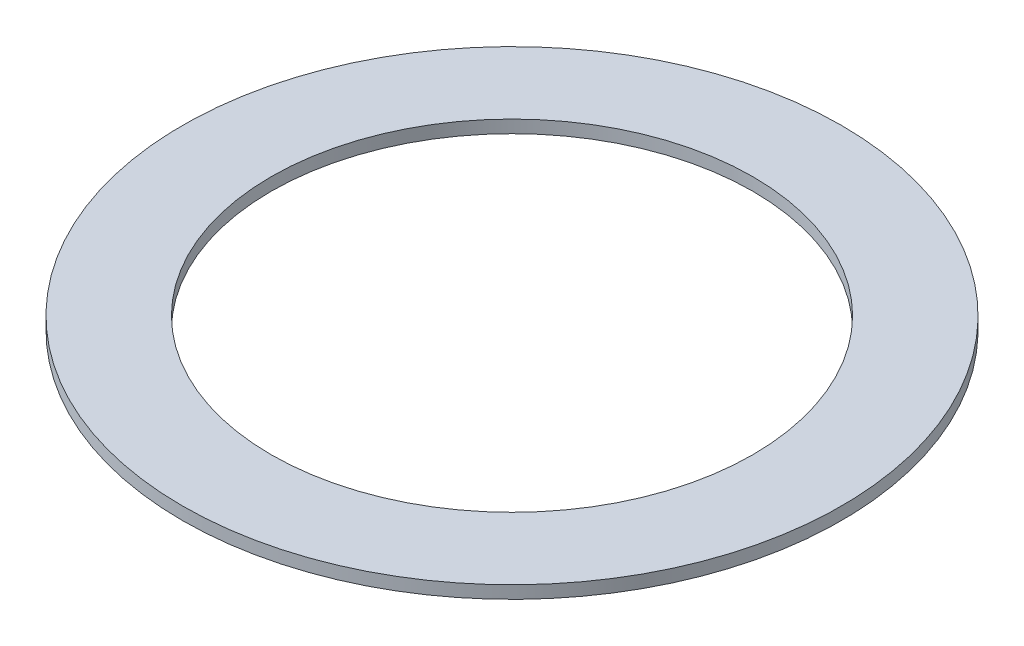
ISO-10303-21;
HEADER;
FILE_DESCRIPTION(('STEP AP214'),'2;1');
FILE_NAME('part.step','',(''),(''),'','','');
FILE_SCHEMA(('AUTOMOTIVE_DESIGN { 1 0 10303 214 1 1 1 1 }'));
ENDSEC;
DATA;
#1=APPLICATION_CONTEXT('core data for automotive mechanical design processes');
#2=APPLICATION_PROTOCOL_DEFINITION('international standard','automotive_design',2000,#1);
#3=PRODUCT_CONTEXT('',#1,'mechanical');
#4=PRODUCT('Part','Part','',(#3));
#5=PRODUCT_RELATED_PRODUCT_CATEGORY('part','',(#4));
#6=PRODUCT_DEFINITION_FORMATION('','',#4);
#7=PRODUCT_DEFINITION_CONTEXT('part definition',#1,'design');
#8=PRODUCT_DEFINITION('design','',#6,#7);
#9=PRODUCT_DEFINITION_SHAPE('','',#8);
#10=(LENGTH_UNIT() NAMED_UNIT(*) SI_UNIT(.MILLI.,.METRE.));
#11=(NAMED_UNIT(*) PLANE_ANGLE_UNIT() SI_UNIT($,.RADIAN.));
#12=(NAMED_UNIT(*) SI_UNIT($,.STERADIAN.) SOLID_ANGLE_UNIT());
#13=UNCERTAINTY_MEASURE_WITH_UNIT(LENGTH_MEASURE(1.E-05),#10,'distance_accuracy_value','');
#14=(GEOMETRIC_REPRESENTATION_CONTEXT(3) GLOBAL_UNCERTAINTY_ASSIGNED_CONTEXT((#13)) GLOBAL_UNIT_ASSIGNED_CONTEXT((#10,
#11,#12)) REPRESENTATION_CONTEXT('',''));
#15=CARTESIAN_POINT('',(0.,0.,0.));
#16=DIRECTION('',(0.,0.,1.));
#17=DIRECTION('',(1.,0.,0.));
#18=AXIS2_PLACEMENT_3D('',#15,#16,#17);
#19=CARTESIAN_POINT('',(0.,0.5,0.));
#20=DIRECTION('',(0.,1.,0.));
#21=DIRECTION('',(0.,0.,1.));
#22=AXIS2_PLACEMENT_3D('',#19,#20,#21);
#23=PLANE('',#22);
#24=CARTESIAN_POINT('',(0.,0.5,0.));
#25=DIRECTION('',(0.,1.,0.));
#26=DIRECTION('',(0.,0.,1.));
#27=AXIS2_PLACEMENT_3D('',#24,#25,#26);
#28=CIRCLE('',#27,13.);
#29=CARTESIAN_POINT('',(0.,0.5,13.));
#30=VERTEX_POINT('',#29);
#31=EDGE_CURVE('E10',#30,#30,#28,.T.);
#32=ORIENTED_EDGE('',*,*,#31,.T.);
#33=EDGE_LOOP('',(#32));
#34=FACE_BOUND('',#33,.T.);
#35=CARTESIAN_POINT('',(0.,0.5,0.));
#36=DIRECTION('',(0.,1.,0.));
#37=DIRECTION('',(0.,0.,1.));
#38=AXIS2_PLACEMENT_3D('',#35,#36,#37);
#39=CIRCLE('',#38,9.5);
#40=CARTESIAN_POINT('',(0.,0.5,9.5));
#41=VERTEX_POINT('',#40);
#42=EDGE_CURVE('E42',#41,#41,#39,.T.);
#43=ORIENTED_EDGE('',*,*,#42,.F.);
#44=EDGE_LOOP('',(#43));
#45=FACE_BOUND('',#44,.T.);
#46=ADVANCED_FACE('F31',(#34,#45),#23,.T.);
#47=CARTESIAN_POINT('',(0.,0.,0.));
#48=DIRECTION('',(0.,1.,0.));
#49=DIRECTION('',(0.,0.,1.));
#50=AXIS2_PLACEMENT_3D('',#47,#48,#49);
#51=PLANE('',#50);
#52=CARTESIAN_POINT('',(0.,0.,0.));
#53=DIRECTION('',(0.,1.,0.));
#54=DIRECTION('',(0.,0.,1.));
#55=AXIS2_PLACEMENT_3D('',#52,#53,#54);
#56=CIRCLE('',#55,13.);
#57=CARTESIAN_POINT('',(0.,0.,13.));
#58=VERTEX_POINT('',#57);
#59=EDGE_CURVE('E35',#58,#58,#56,.T.);
#60=ORIENTED_EDGE('',*,*,#59,.F.);
#61=EDGE_LOOP('',(#60));
#62=FACE_BOUND('',#61,.T.);
#63=CARTESIAN_POINT('',(0.,0.,0.));
#64=DIRECTION('',(0.,1.,0.));
#65=DIRECTION('',(0.,0.,1.));
#66=AXIS2_PLACEMENT_3D('',#63,#64,#65);
#67=CIRCLE('',#66,9.5);
#68=CARTESIAN_POINT('',(0.,0.,9.5));
#69=VERTEX_POINT('',#68);
#70=EDGE_CURVE('E44',#69,#69,#67,.T.);
#71=ORIENTED_EDGE('',*,*,#70,.T.);
#72=EDGE_LOOP('',(#71));
#73=FACE_BOUND('',#72,.T.);
#74=ADVANCED_FACE('F54',(#62,#73),#51,.F.);
#75=CARTESIAN_POINT('',(0.,0.5,0.));
#76=DIRECTION('',(0.,-1.,0.));
#77=DIRECTION('',(0.,0.,-1.));
#78=AXIS2_PLACEMENT_3D('',#75,#76,#77);
#79=CYLINDRICAL_SURFACE('',#78,13.);
#80=ORIENTED_EDGE('',*,*,#31,.F.);
#81=EDGE_LOOP('',(#80));
#82=FACE_BOUND('',#81,.T.);
#83=ORIENTED_EDGE('',*,*,#59,.T.);
#84=EDGE_LOOP('',(#83));
#85=FACE_BOUND('',#84,.T.);
#86=ADVANCED_FACE('F33',(#82,#85),#79,.T.);
#87=CARTESIAN_POINT('',(0.,0.5,0.));
#88=DIRECTION('',(0.,-1.,0.));
#89=DIRECTION('',(0.,0.,-1.));
#90=AXIS2_PLACEMENT_3D('',#87,#88,#89);
#91=CYLINDRICAL_SURFACE('',#90,9.5);
#92=ORIENTED_EDGE('',*,*,#42,.T.);
#93=EDGE_LOOP('',(#92));
#94=FACE_BOUND('',#93,.T.);
#95=ORIENTED_EDGE('',*,*,#70,.F.);
#96=EDGE_LOOP('',(#95));
#97=FACE_BOUND('',#96,.T.);
#98=ADVANCED_FACE('F50',(#94,#97),#91,.F.);
#99=CLOSED_SHELL('',(#46,#74,#86,#98));
#100=MANIFOLD_SOLID_BREP('B2',#99);
#101=ADVANCED_BREP_SHAPE_REPRESENTATION('',(#18,#100),#14);
#102=SHAPE_DEFINITION_REPRESENTATION(#9,#101);
ENDSEC;
END-ISO-10303-21;
